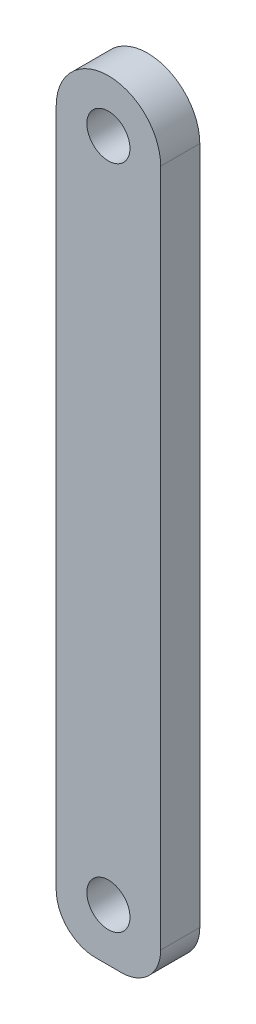
ISO-10303-21;
HEADER;
FILE_DESCRIPTION(('STEP AP214'),'2;1');
FILE_NAME('part.step','',(''),(''),'','','');
FILE_SCHEMA(('AUTOMOTIVE_DESIGN { 1 0 10303 214 1 1 1 1 }'));
ENDSEC;
DATA;
#1=APPLICATION_CONTEXT('core data for automotive mechanical design processes');
#2=APPLICATION_PROTOCOL_DEFINITION('international standard','automotive_design',2000,#1);
#3=PRODUCT_CONTEXT('',#1,'mechanical');
#4=PRODUCT('Part','Part','',(#3));
#5=PRODUCT_RELATED_PRODUCT_CATEGORY('part','',(#4));
#6=PRODUCT_DEFINITION_FORMATION('','',#4);
#7=PRODUCT_DEFINITION_CONTEXT('part definition',#1,'design');
#8=PRODUCT_DEFINITION('design','',#6,#7);
#9=PRODUCT_DEFINITION_SHAPE('','',#8);
#10=(LENGTH_UNIT() NAMED_UNIT(*) SI_UNIT(.MILLI.,.METRE.));
#11=(NAMED_UNIT(*) PLANE_ANGLE_UNIT() SI_UNIT($,.RADIAN.));
#12=(NAMED_UNIT(*) SI_UNIT($,.STERADIAN.) SOLID_ANGLE_UNIT());
#13=UNCERTAINTY_MEASURE_WITH_UNIT(LENGTH_MEASURE(1.E-05),#10,'distance_accuracy_value','');
#14=(GEOMETRIC_REPRESENTATION_CONTEXT(3) GLOBAL_UNCERTAINTY_ASSIGNED_CONTEXT((#13)) GLOBAL_UNIT_ASSIGNED_CONTEXT((#10,
#11,#12)) REPRESENTATION_CONTEXT('',''));
#15=CARTESIAN_POINT('',(0.,0.,0.));
#16=DIRECTION('',(0.,0.,1.));
#17=DIRECTION('',(1.,0.,0.));
#18=AXIS2_PLACEMENT_3D('',#15,#16,#17);
#19=CARTESIAN_POINT('',(0.,25.5,0.));
#20=DIRECTION('',(0.,0.,-1.));
#21=DIRECTION('',(-1.,0.,0.));
#22=AXIS2_PLACEMENT_3D('',#19,#20,#21);
#23=CYLINDRICAL_SURFACE('',#22,4.);
#24=DIRECTION('',(0.,0.,-1.));
#25=VECTOR('',#24,1.);
#26=CARTESIAN_POINT('',(4.,25.5,3.));
#27=LINE('',#26,#25);
#28=CARTESIAN_POINT('',(4.,25.5,0.));
#29=VERTEX_POINT('',#28);
#30=CARTESIAN_POINT('',(4.,25.5,3.));
#31=VERTEX_POINT('',#30);
#32=EDGE_CURVE('E100',#29,#31,#27,.F.);
#33=ORIENTED_EDGE('',*,*,#32,.F.);
#34=CARTESIAN_POINT('',(0.,25.5,0.));
#35=DIRECTION('',(0.,0.,-1.));
#36=DIRECTION('',(-1.,0.,0.));
#37=AXIS2_PLACEMENT_3D('',#34,#35,#36);
#38=CIRCLE('',#37,4.);
#39=CARTESIAN_POINT('',(-4.,25.5,0.));
#40=VERTEX_POINT('',#39);
#41=EDGE_CURVE('E43',#40,#29,#38,.T.);
#42=ORIENTED_EDGE('',*,*,#41,.F.);
#43=DIRECTION('',(0.,0.,-1.));
#44=VECTOR('',#43,1.);
#45=CARTESIAN_POINT('',(-4.,25.5,3.));
#46=LINE('',#45,#44);
#47=CARTESIAN_POINT('',(-4.,25.5,3.));
#48=VERTEX_POINT('',#47);
#49=EDGE_CURVE('E133',#48,#40,#46,.T.);
#50=ORIENTED_EDGE('',*,*,#49,.F.);
#51=CARTESIAN_POINT('',(0.,25.5,3.));
#52=DIRECTION('',(0.,0.,-1.));
#53=DIRECTION('',(-1.,0.,0.));
#54=AXIS2_PLACEMENT_3D('',#51,#52,#53);
#55=CIRCLE('',#54,4.);
#56=EDGE_CURVE('E11',#31,#48,#55,.F.);
#57=ORIENTED_EDGE('',*,*,#56,.F.);
#58=EDGE_LOOP('',(#33,#42,#50,#57));
#59=FACE_BOUND('',#58,.T.);
#60=ADVANCED_FACE('F35',(#59),#23,.T.);
#61=CARTESIAN_POINT('',(-1.,-26.5,3.));
#62=DIRECTION('',(0.,0.,-1.));
#63=DIRECTION('',(-1.,0.,0.));
#64=AXIS2_PLACEMENT_3D('',#61,#62,#63);
#65=PLANE('',#64);
#66=DIRECTION('',(0.,1.,0.));
#67=VECTOR('',#66,1.);
#68=CARTESIAN_POINT('',(4.,-26.5,3.));
#69=LINE('',#68,#67);
#70=CARTESIAN_POINT('',(4.,-26.5,3.));
#71=VERTEX_POINT('',#70);
#72=EDGE_CURVE('E91',#71,#31,#69,.T.);
#73=ORIENTED_EDGE('',*,*,#72,.T.);
#74=ORIENTED_EDGE('',*,*,#56,.T.);
#75=DIRECTION('',(0.,-1.,0.));
#76=VECTOR('',#75,1.);
#77=CARTESIAN_POINT('',(-4.,-26.5,3.));
#78=LINE('',#77,#76);
#79=CARTESIAN_POINT('',(-4.,-26.5,3.));
#80=VERTEX_POINT('',#79);
#81=EDGE_CURVE('E83',#48,#80,#78,.T.);
#82=ORIENTED_EDGE('',*,*,#81,.T.);
#83=CARTESIAN_POINT('',(-1.,-26.5,3.));
#84=DIRECTION('',(0.,0.,1.));
#85=DIRECTION('',(-1.,0.,0.));
#86=AXIS2_PLACEMENT_3D('',#83,#84,#85);
#87=CIRCLE('',#86,3.);
#88=CARTESIAN_POINT('',(-0.999999999999979,-29.5,3.));
#89=VERTEX_POINT('',#88);
#90=EDGE_CURVE('E88',#80,#89,#87,.T.);
#91=ORIENTED_EDGE('',*,*,#90,.T.);
#92=DIRECTION('',(1.,0.,0.));
#93=VECTOR('',#92,1.);
#94=CARTESIAN_POINT('',(-0.999999999999979,-29.5,3.));
#95=LINE('',#94,#93);
#96=CARTESIAN_POINT('',(0.999999999999979,-29.5,3.));
#97=VERTEX_POINT('',#96);
#98=EDGE_CURVE('E106',#89,#97,#95,.T.);
#99=ORIENTED_EDGE('',*,*,#98,.T.);
#100=CARTESIAN_POINT('',(1.,-26.5,3.));
#101=DIRECTION('',(0.,0.,1.));
#102=DIRECTION('',(-1.,0.,0.));
#103=AXIS2_PLACEMENT_3D('',#100,#101,#102);
#104=CIRCLE('',#103,3.);
#105=EDGE_CURVE('E108',#97,#71,#104,.T.);
#106=ORIENTED_EDGE('',*,*,#105,.T.);
#107=EDGE_LOOP('',(#73,#74,#82,#91,#99,#106));
#108=FACE_BOUND('',#107,.T.);
#109=CARTESIAN_POINT('',(0.,25.5,3.));
#110=DIRECTION('',(0.,0.,1.));
#111=DIRECTION('',(1.,0.,0.));
#112=AXIS2_PLACEMENT_3D('',#109,#110,#111);
#113=CIRCLE('',#112,1.65);
#114=CARTESIAN_POINT('',(1.65,25.5,3.));
#115=VERTEX_POINT('',#114);
#116=EDGE_CURVE('E117',#115,#115,#113,.T.);
#117=ORIENTED_EDGE('',*,*,#116,.F.);
#118=EDGE_LOOP('',(#117));
#119=FACE_BOUND('',#118,.T.);
#120=CARTESIAN_POINT('',(0.,-25.5,3.));
#121=DIRECTION('',(0.,0.,1.));
#122=DIRECTION('',(1.,0.,0.));
#123=AXIS2_PLACEMENT_3D('',#120,#121,#122);
#124=CIRCLE('',#123,1.65);
#125=CARTESIAN_POINT('',(1.65,-25.5,3.));
#126=VERTEX_POINT('',#125);
#127=EDGE_CURVE('E154',#126,#126,#124,.T.);
#128=ORIENTED_EDGE('',*,*,#127,.F.);
#129=EDGE_LOOP('',(#128));
#130=FACE_BOUND('',#129,.T.);
#131=ADVANCED_FACE('F85',(#108,#119,#130),#65,.F.);
#132=CARTESIAN_POINT('',(-1.,-26.5,0.));
#133=DIRECTION('',(0.,0.,-1.));
#134=DIRECTION('',(-1.,0.,0.));
#135=AXIS2_PLACEMENT_3D('',#132,#133,#134);
#136=PLANE('',#135);
#137=CARTESIAN_POINT('',(0.,25.5,0.));
#138=DIRECTION('',(0.,0.,1.));
#139=DIRECTION('',(1.,0.,0.));
#140=AXIS2_PLACEMENT_3D('',#137,#138,#139);
#141=CIRCLE('',#140,1.65);
#142=CARTESIAN_POINT('',(1.65,25.5,0.));
#143=VERTEX_POINT('',#142);
#144=EDGE_CURVE('E151',#143,#143,#141,.T.);
#145=ORIENTED_EDGE('',*,*,#144,.T.);
#146=EDGE_LOOP('',(#145));
#147=FACE_BOUND('',#146,.T.);
#148=DIRECTION('',(0.,-1.,0.));
#149=VECTOR('',#148,1.);
#150=CARTESIAN_POINT('',(-4.,-26.5,0.));
#151=LINE('',#150,#149);
#152=CARTESIAN_POINT('',(-4.,-26.5,0.));
#153=VERTEX_POINT('',#152);
#154=EDGE_CURVE('E97',#40,#153,#151,.T.);
#155=ORIENTED_EDGE('',*,*,#154,.F.);
#156=ORIENTED_EDGE('',*,*,#41,.T.);
#157=DIRECTION('',(0.,1.,0.));
#158=VECTOR('',#157,1.);
#159=CARTESIAN_POINT('',(4.,-26.5,0.));
#160=LINE('',#159,#158);
#161=CARTESIAN_POINT('',(4.,-26.5,0.));
#162=VERTEX_POINT('',#161);
#163=EDGE_CURVE('E114',#162,#29,#160,.T.);
#164=ORIENTED_EDGE('',*,*,#163,.F.);
#165=CARTESIAN_POINT('',(1.,-26.5,0.));
#166=DIRECTION('',(0.,0.,1.));
#167=DIRECTION('',(-1.,0.,0.));
#168=AXIS2_PLACEMENT_3D('',#165,#166,#167);
#169=CIRCLE('',#168,3.);
#170=CARTESIAN_POINT('',(0.999999999999979,-29.5,0.));
#171=VERTEX_POINT('',#170);
#172=EDGE_CURVE('E123',#171,#162,#169,.T.);
#173=ORIENTED_EDGE('',*,*,#172,.F.);
#174=DIRECTION('',(1.,0.,0.));
#175=VECTOR('',#174,1.);
#176=CARTESIAN_POINT('',(-0.999999999999979,-29.5,0.));
#177=LINE('',#176,#175);
#178=CARTESIAN_POINT('',(-0.999999999999979,-29.5,0.));
#179=VERTEX_POINT('',#178);
#180=EDGE_CURVE('E121',#179,#171,#177,.T.);
#181=ORIENTED_EDGE('',*,*,#180,.F.);
#182=CARTESIAN_POINT('',(-1.,-26.5,0.));
#183=DIRECTION('',(0.,0.,1.));
#184=DIRECTION('',(-1.,0.,0.));
#185=AXIS2_PLACEMENT_3D('',#182,#183,#184);
#186=CIRCLE('',#185,3.);
#187=EDGE_CURVE('E119',#153,#179,#186,.T.);
#188=ORIENTED_EDGE('',*,*,#187,.F.);
#189=EDGE_LOOP('',(#155,#156,#164,#173,#181,#188));
#190=FACE_BOUND('',#189,.T.);
#191=CARTESIAN_POINT('',(0.,-25.5,0.));
#192=DIRECTION('',(0.,0.,1.));
#193=DIRECTION('',(1.,0.,0.));
#194=AXIS2_PLACEMENT_3D('',#191,#192,#193);
#195=CIRCLE('',#194,1.65);
#196=CARTESIAN_POINT('',(1.65,-25.5,0.));
#197=VERTEX_POINT('',#196);
#198=EDGE_CURVE('E157',#197,#197,#195,.T.);
#199=ORIENTED_EDGE('',*,*,#198,.T.);
#200=EDGE_LOOP('',(#199));
#201=FACE_BOUND('',#200,.T.);
#202=ADVANCED_FACE('F136',(#147,#190,#201),#136,.T.);
#203=CARTESIAN_POINT('',(4.,-26.5,3.));
#204=DIRECTION('',(-1.,0.,0.));
#205=DIRECTION('',(0.,0.,1.));
#206=AXIS2_PLACEMENT_3D('',#203,#204,#205);
#207=PLANE('',#206);
#208=ORIENTED_EDGE('',*,*,#163,.T.);
#209=ORIENTED_EDGE('',*,*,#32,.T.);
#210=ORIENTED_EDGE('',*,*,#72,.F.);
#211=DIRECTION('',(0.,0.,-1.));
#212=VECTOR('',#211,1.);
#213=CARTESIAN_POINT('',(4.,-26.5,3.));
#214=LINE('',#213,#212);
#215=EDGE_CURVE('E113',#71,#162,#214,.T.);
#216=ORIENTED_EDGE('',*,*,#215,.T.);
#217=EDGE_LOOP('',(#208,#209,#210,#216));
#218=FACE_BOUND('',#217,.T.);
#219=ADVANCED_FACE('F141',(#218),#207,.F.);
#220=CARTESIAN_POINT('',(-4.,-26.5,3.));
#221=DIRECTION('',(1.,0.,0.));
#222=DIRECTION('',(0.,0.,-1.));
#223=AXIS2_PLACEMENT_3D('',#220,#221,#222);
#224=PLANE('',#223);
#225=ORIENTED_EDGE('',*,*,#81,.F.);
#226=ORIENTED_EDGE('',*,*,#49,.T.);
#227=ORIENTED_EDGE('',*,*,#154,.T.);
#228=DIRECTION('',(0.,0.,-1.));
#229=VECTOR('',#228,1.);
#230=CARTESIAN_POINT('',(-4.,-26.5,3.));
#231=LINE('',#230,#229);
#232=EDGE_CURVE('E94',#80,#153,#231,.T.);
#233=ORIENTED_EDGE('',*,*,#232,.F.);
#234=EDGE_LOOP('',(#225,#226,#227,#233));
#235=FACE_BOUND('',#234,.T.);
#236=ADVANCED_FACE('F95',(#235),#224,.F.);
#237=CARTESIAN_POINT('',(-1.,-26.5,3.));
#238=DIRECTION('',(0.,0.,-1.));
#239=DIRECTION('',(-1.,0.,0.));
#240=AXIS2_PLACEMENT_3D('',#237,#238,#239);
#241=CYLINDRICAL_SURFACE('',#240,3.);
#242=ORIENTED_EDGE('',*,*,#187,.T.);
#243=DIRECTION('',(0.,0.,-1.));
#244=VECTOR('',#243,1.);
#245=CARTESIAN_POINT('',(-0.999999999999979,-29.5,3.));
#246=LINE('',#245,#244);
#247=EDGE_CURVE('E101',#89,#179,#246,.T.);
#248=ORIENTED_EDGE('',*,*,#247,.F.);
#249=ORIENTED_EDGE('',*,*,#90,.F.);
#250=ORIENTED_EDGE('',*,*,#232,.T.);
#251=EDGE_LOOP('',(#242,#248,#249,#250));
#252=FACE_BOUND('',#251,.T.);
#253=ADVANCED_FACE('F103',(#252),#241,.T.);
#254=CARTESIAN_POINT('',(-0.999999999999979,-29.5,3.));
#255=DIRECTION('',(0.,1.,0.));
#256=DIRECTION('',(0.,0.,1.));
#257=AXIS2_PLACEMENT_3D('',#254,#255,#256);
#258=PLANE('',#257);
#259=ORIENTED_EDGE('',*,*,#180,.T.);
#260=DIRECTION('',(0.,0.,-1.));
#261=VECTOR('',#260,1.);
#262=CARTESIAN_POINT('',(0.999999999999979,-29.5,3.));
#263=LINE('',#262,#261);
#264=EDGE_CURVE('E127',#97,#171,#263,.T.);
#265=ORIENTED_EDGE('',*,*,#264,.F.);
#266=ORIENTED_EDGE('',*,*,#98,.F.);
#267=ORIENTED_EDGE('',*,*,#247,.T.);
#268=EDGE_LOOP('',(#259,#265,#266,#267));
#269=FACE_BOUND('',#268,.T.);
#270=ADVANCED_FACE('F149',(#269),#258,.F.);
#271=CARTESIAN_POINT('',(1.,-26.5,3.));
#272=DIRECTION('',(0.,0.,-1.));
#273=DIRECTION('',(-1.,0.,0.));
#274=AXIS2_PLACEMENT_3D('',#271,#272,#273);
#275=CYLINDRICAL_SURFACE('',#274,3.);
#276=ORIENTED_EDGE('',*,*,#172,.T.);
#277=ORIENTED_EDGE('',*,*,#215,.F.);
#278=ORIENTED_EDGE('',*,*,#105,.F.);
#279=ORIENTED_EDGE('',*,*,#264,.T.);
#280=EDGE_LOOP('',(#276,#277,#278,#279));
#281=FACE_BOUND('',#280,.T.);
#282=ADVANCED_FACE('F145',(#281),#275,.T.);
#283=CARTESIAN_POINT('',(0.,25.5,3.));
#284=DIRECTION('',(0.,0.,-1.));
#285=DIRECTION('',(-1.,0.,0.));
#286=AXIS2_PLACEMENT_3D('',#283,#284,#285);
#287=CYLINDRICAL_SURFACE('',#286,1.65);
#288=ORIENTED_EDGE('',*,*,#116,.T.);
#289=EDGE_LOOP('',(#288));
#290=FACE_BOUND('',#289,.T.);
#291=ORIENTED_EDGE('',*,*,#144,.F.);
#292=EDGE_LOOP('',(#291));
#293=FACE_BOUND('',#292,.T.);
#294=ADVANCED_FACE('F175',(#290,#293),#287,.F.);
#295=CARTESIAN_POINT('',(0.,-25.5,3.));
#296=DIRECTION('',(0.,0.,-1.));
#297=DIRECTION('',(-1.,0.,0.));
#298=AXIS2_PLACEMENT_3D('',#295,#296,#297);
#299=CYLINDRICAL_SURFACE('',#298,1.65);
#300=ORIENTED_EDGE('',*,*,#127,.T.);
#301=EDGE_LOOP('',(#300));
#302=FACE_BOUND('',#301,.T.);
#303=ORIENTED_EDGE('',*,*,#198,.F.);
#304=EDGE_LOOP('',(#303));
#305=FACE_BOUND('',#304,.T.);
#306=ADVANCED_FACE('F163',(#302,#305),#299,.F.);
#307=CLOSED_SHELL('',(#60,#131,#202,#219,#236,#253,#270,#282,#294,#306));
#308=MANIFOLD_SOLID_BREP('B2',#307);
#309=ADVANCED_BREP_SHAPE_REPRESENTATION('',(#18,#308),#14);
#310=SHAPE_DEFINITION_REPRESENTATION(#9,#309);
ENDSEC;
END-ISO-10303-21;
